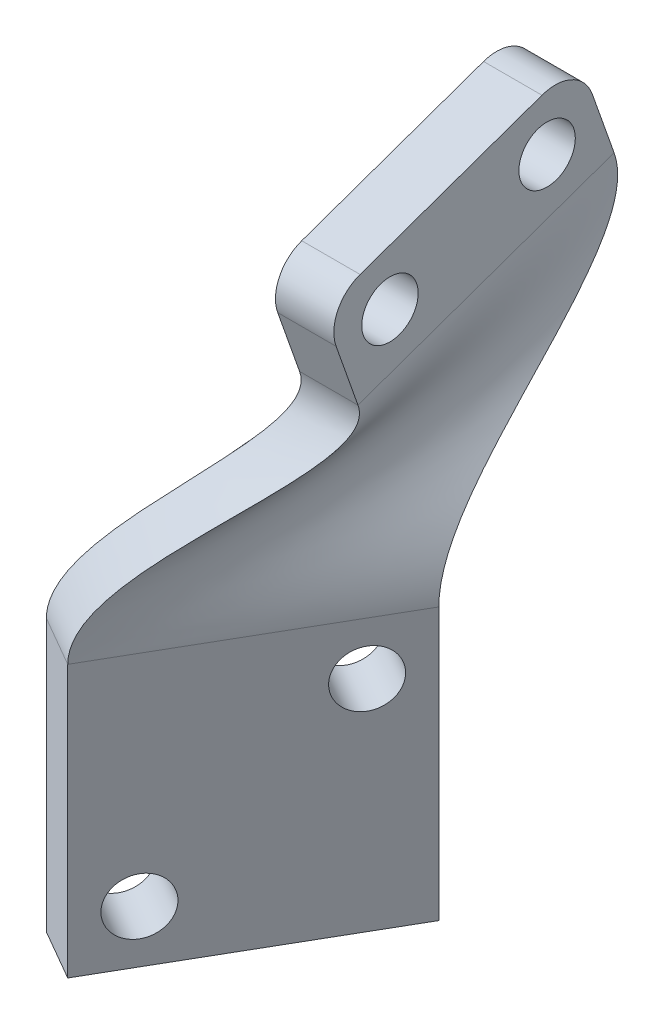
ISO-10303-21;
HEADER;
FILE_DESCRIPTION(('STEP AP214'),'2;1');
FILE_NAME('part.step','',(''),(''),'','','');
FILE_SCHEMA(('AUTOMOTIVE_DESIGN { 1 0 10303 214 1 1 1 1 }'));
ENDSEC;
DATA;
#1=APPLICATION_CONTEXT('core data for automotive mechanical design processes');
#2=APPLICATION_PROTOCOL_DEFINITION('international standard','automotive_design',2000,#1);
#3=PRODUCT_CONTEXT('',#1,'mechanical');
#4=PRODUCT('Part','Part','',(#3));
#5=PRODUCT_RELATED_PRODUCT_CATEGORY('part','',(#4));
#6=PRODUCT_DEFINITION_FORMATION('','',#4);
#7=PRODUCT_DEFINITION_CONTEXT('part definition',#1,'design');
#8=PRODUCT_DEFINITION('design','',#6,#7);
#9=PRODUCT_DEFINITION_SHAPE('','',#8);
#10=(LENGTH_UNIT() NAMED_UNIT(*) SI_UNIT(.MILLI.,.METRE.));
#11=(NAMED_UNIT(*) PLANE_ANGLE_UNIT() SI_UNIT($,.RADIAN.));
#12=(NAMED_UNIT(*) SI_UNIT($,.STERADIAN.) SOLID_ANGLE_UNIT());
#13=UNCERTAINTY_MEASURE_WITH_UNIT(LENGTH_MEASURE(1.E-05),#10,'distance_accuracy_value','');
#14=(GEOMETRIC_REPRESENTATION_CONTEXT(3) GLOBAL_UNCERTAINTY_ASSIGNED_CONTEXT((#13)) GLOBAL_UNIT_ASSIGNED_CONTEXT((#10,
#11,#12)) REPRESENTATION_CONTEXT('',''));
#15=CARTESIAN_POINT('',(0.,0.,0.));
#16=DIRECTION('',(0.,0.,1.));
#17=DIRECTION('',(1.,0.,0.));
#18=AXIS2_PLACEMENT_3D('',#15,#16,#17);
#19=CARTESIAN_POINT('',(36.0126016447789,0.,20.7918852538318));
#20=DIRECTION('',(0.866025403784439,0.,0.5));
#21=DIRECTION('',(-0.5,0.,0.866025403784439));
#22=AXIS2_PLACEMENT_3D('',#19,#20,#21);
#23=PLANE('',#22);
#24=CARTESIAN_POINT('',(-21.2182498916146,15.127724603936,119.918627875297));
#25=DIRECTION('',(-0.866025403784438,0.,-0.5));
#26=DIRECTION('',(-0.5,0.,0.866025403784438));
#27=AXIS2_PLACEMENT_3D('',#24,#25,#26);
#28=CIRCLE('',#27,2.15000000000001);
#29=CARTESIAN_POINT('',(-22.2932498916146,15.127724603936,121.780582493433));
#30=VERTEX_POINT('',#29);
#31=EDGE_CURVE('E308',#30,#30,#28,.T.);
#32=ORIENTED_EDGE('',*,*,#31,.T.);
#33=EDGE_LOOP('',(#32));
#34=FACE_BOUND('',#33,.T.);
#35=DIRECTION('',(0.,-1.,0.));
#36=VECTOR('',#35,1.);
#37=CARTESIAN_POINT('',(-19.2182498916146,19.127724603936,116.454526260159));
#38=LINE('',#37,#36);
#39=CARTESIAN_POINT('',(-19.2182498916146,19.127724603936,116.454526260159));
#40=VERTEX_POINT('',#39);
#41=CARTESIAN_POINT('',(-19.2182498916146,-1.57227539606404,116.454526260159));
#42=VERTEX_POINT('',#41);
#43=EDGE_CURVE('E318',#40,#42,#38,.T.);
#44=ORIENTED_EDGE('',*,*,#43,.F.);
#45=DIRECTION('',(-0.5,0.,0.866025403784439));
#46=VECTOR('',#45,1.);
#47=CARTESIAN_POINT('',(36.0126016447789,19.127724603936,20.7918852538319));
#48=LINE('',#47,#46);
#49=CARTESIAN_POINT('',(-29.5682498916146,19.127724603936,134.381252118497));
#50=VERTEX_POINT('',#49);
#51=EDGE_CURVE('E152',#50,#40,#48,.F.);
#52=ORIENTED_EDGE('',*,*,#51,.F.);
#53=DIRECTION('',(0.,1.,0.));
#54=VECTOR('',#53,1.);
#55=CARTESIAN_POINT('',(-29.5682498916146,19.127724603936,134.381252118497));
#56=LINE('',#55,#54);
#57=CARTESIAN_POINT('',(-29.5682498916146,-1.57227539606404,134.381252118497));
#58=VERTEX_POINT('',#57);
#59=EDGE_CURVE('E317',#58,#50,#56,.T.);
#60=ORIENTED_EDGE('',*,*,#59,.F.);
#61=DIRECTION('',(-0.5,0.,0.866025403784439));
#62=VECTOR('',#61,1.);
#63=CARTESIAN_POINT('',(-19.2182498916146,-1.57227539606404,116.454526260159));
#64=LINE('',#63,#62);
#65=EDGE_CURVE('E314',#42,#58,#64,.T.);
#66=ORIENTED_EDGE('',*,*,#65,.F.);
#67=EDGE_LOOP('',(#44,#52,#60,#66));
#68=FACE_BOUND('',#67,.T.);
#69=CARTESIAN_POINT('',(-27.5682498916146,2.42772460393596,130.917150503359));
#70=DIRECTION('',(-0.866025403784438,0.,-0.5));
#71=DIRECTION('',(-0.5,0.,0.866025403784438));
#72=AXIS2_PLACEMENT_3D('',#69,#70,#71);
#73=CIRCLE('',#72,2.15000000000001);
#74=CARTESIAN_POINT('',(-28.6432498916146,2.42772460393596,132.779105121496));
#75=VERTEX_POINT('',#74);
#76=EDGE_CURVE('E296',#75,#75,#73,.T.);
#77=ORIENTED_EDGE('',*,*,#76,.T.);
#78=EDGE_LOOP('',(#77));
#79=FACE_BOUND('',#78,.T.);
#80=ADVANCED_FACE('F45',(#34,#68,#79),#23,.T.);
#81=CARTESIAN_POINT('',(32.1587885979381,0.,18.5668852538318));
#82=DIRECTION('',(0.866025403784439,0.,0.5));
#83=DIRECTION('',(-0.5,0.,0.866025403784439));
#84=AXIS2_PLACEMENT_3D('',#81,#82,#83);
#85=PLANE('',#84);
#86=DIRECTION('',(0.,-1.,0.));
#87=VECTOR('',#86,1.);
#88=CARTESIAN_POINT('',(-23.0720629384553,19.127724603936,114.229526260159));
#89=LINE('',#88,#87);
#90=CARTESIAN_POINT('',(-23.0720629384553,19.127724603936,114.229526260159));
#91=VERTEX_POINT('',#90);
#92=CARTESIAN_POINT('',(-23.0720629384553,-1.57227539606404,114.229526260159));
#93=VERTEX_POINT('',#92);
#94=EDGE_CURVE('E311',#91,#93,#89,.T.);
#95=ORIENTED_EDGE('',*,*,#94,.T.);
#96=DIRECTION('',(-0.5,0.,0.866025403784439));
#97=VECTOR('',#96,1.);
#98=CARTESIAN_POINT('',(-23.0720629384553,-1.57227539606404,114.229526260159));
#99=LINE('',#98,#97);
#100=CARTESIAN_POINT('',(-33.4220629384554,-1.57227539606403,132.156252118497));
#101=VERTEX_POINT('',#100);
#102=EDGE_CURVE('E319',#93,#101,#99,.T.);
#103=ORIENTED_EDGE('',*,*,#102,.T.);
#104=DIRECTION('',(0.,1.,0.));
#105=VECTOR('',#104,1.);
#106=CARTESIAN_POINT('',(-33.4220629384554,19.127724603936,132.156252118497));
#107=LINE('',#106,#105);
#108=CARTESIAN_POINT('',(-33.4220629384554,19.127724603936,132.156252118497));
#109=VERTEX_POINT('',#108);
#110=EDGE_CURVE('E322',#101,#109,#107,.T.);
#111=ORIENTED_EDGE('',*,*,#110,.T.);
#112=DIRECTION('',(-0.5,0.,0.866025403784439));
#113=VECTOR('',#112,1.);
#114=CARTESIAN_POINT('',(32.1587885979381,19.127724603936,18.5668852538318));
#115=LINE('',#114,#113);
#116=EDGE_CURVE('E330',#109,#91,#115,.F.);
#117=ORIENTED_EDGE('',*,*,#116,.T.);
#118=EDGE_LOOP('',(#95,#103,#111,#117));
#119=FACE_BOUND('',#118,.T.);
#120=CARTESIAN_POINT('',(-25.0720629384553,15.127724603936,117.693627875297));
#121=DIRECTION('',(-0.866025403784438,0.,-0.5));
#122=DIRECTION('',(-0.5,0.,0.866025403784438));
#123=AXIS2_PLACEMENT_3D('',#120,#121,#122);
#124=CIRCLE('',#123,2.15000000000001);
#125=CARTESIAN_POINT('',(-26.1470629384553,15.127724603936,119.555582493433));
#126=VERTEX_POINT('',#125);
#127=EDGE_CURVE('E304',#126,#126,#124,.T.);
#128=ORIENTED_EDGE('',*,*,#127,.F.);
#129=EDGE_LOOP('',(#128));
#130=FACE_BOUND('',#129,.T.);
#131=CARTESIAN_POINT('',(-31.4220629384554,2.42772460393596,128.692150503359));
#132=DIRECTION('',(-0.866025403784438,0.,-0.5));
#133=DIRECTION('',(-0.5,0.,0.866025403784438));
#134=AXIS2_PLACEMENT_3D('',#131,#132,#133);
#135=CIRCLE('',#134,2.15000000000001);
#136=CARTESIAN_POINT('',(-32.4970629384554,2.42772460393596,130.554105121496));
#137=VERTEX_POINT('',#136);
#138=EDGE_CURVE('E305',#137,#137,#135,.T.);
#139=ORIENTED_EDGE('',*,*,#138,.F.);
#140=EDGE_LOOP('',(#139));
#141=FACE_BOUND('',#140,.T.);
#142=ADVANCED_FACE('F348',(#119,#130,#141),#85,.F.);
#143=CARTESIAN_POINT('',(-19.2182498916146,19.127724603936,116.454526260159));
#144=DIRECTION('',(-0.500000000000001,0.,0.866025403784438));
#145=DIRECTION('',(-0.866025403784438,0.,-0.500000000000001));
#146=AXIS2_PLACEMENT_3D('',#143,#144,#145);
#147=PLANE('',#146);
#148=ORIENTED_EDGE('',*,*,#94,.F.);
#149=DIRECTION('',(-0.866025403784438,0.,-0.500000000000001));
#150=VECTOR('',#149,1.);
#151=CARTESIAN_POINT('',(-19.2182498916146,19.127724603936,116.454526260159));
#152=LINE('',#151,#150);
#153=EDGE_CURVE('E341',#40,#91,#152,.T.);
#154=ORIENTED_EDGE('',*,*,#153,.F.);
#155=ORIENTED_EDGE('',*,*,#43,.T.);
#156=DIRECTION('',(-0.866025403784438,0.,-0.500000000000001));
#157=VECTOR('',#156,1.);
#158=CARTESIAN_POINT('',(-19.2182498916146,-1.57227539606404,116.454526260159));
#159=LINE('',#158,#157);
#160=EDGE_CURVE('E325',#42,#93,#159,.T.);
#161=ORIENTED_EDGE('',*,*,#160,.T.);
#162=EDGE_LOOP('',(#148,#154,#155,#161));
#163=FACE_BOUND('',#162,.T.);
#164=ADVANCED_FACE('F351',(#163),#147,.F.);
#165=CARTESIAN_POINT('',(-19.2182498916146,-1.57227539606404,116.454526260159));
#166=DIRECTION('',(0.,1.,0.));
#167=DIRECTION('',(-1.,0.,0.));
#168=AXIS2_PLACEMENT_3D('',#165,#166,#167);
#169=PLANE('',#168);
#170=ORIENTED_EDGE('',*,*,#102,.F.);
#171=ORIENTED_EDGE('',*,*,#160,.F.);
#172=ORIENTED_EDGE('',*,*,#65,.T.);
#173=DIRECTION('',(-0.866025403784438,0.,-0.500000000000001));
#174=VECTOR('',#173,1.);
#175=CARTESIAN_POINT('',(-29.5682498916146,-1.57227539606404,134.381252118497));
#176=LINE('',#175,#174);
#177=EDGE_CURVE('E323',#58,#101,#176,.T.);
#178=ORIENTED_EDGE('',*,*,#177,.T.);
#179=EDGE_LOOP('',(#170,#171,#172,#178));
#180=FACE_BOUND('',#179,.T.);
#181=ADVANCED_FACE('F355',(#180),#169,.F.);
#182=CARTESIAN_POINT('',(-29.5682498916146,19.127724603936,134.381252118497));
#183=DIRECTION('',(0.500000000000001,0.,-0.866025403784438));
#184=DIRECTION('',(0.866025403784438,0.,0.500000000000001));
#185=AXIS2_PLACEMENT_3D('',#182,#183,#184);
#186=PLANE('',#185);
#187=ORIENTED_EDGE('',*,*,#110,.F.);
#188=ORIENTED_EDGE('',*,*,#177,.F.);
#189=ORIENTED_EDGE('',*,*,#59,.T.);
#190=DIRECTION('',(0.866025403784438,0.,0.500000000000001));
#191=VECTOR('',#190,1.);
#192=CARTESIAN_POINT('',(-29.5682498916146,19.127724603936,134.381252118497));
#193=LINE('',#192,#191);
#194=EDGE_CURVE('E326',#50,#109,#193,.F.);
#195=ORIENTED_EDGE('',*,*,#194,.T.);
#196=EDGE_LOOP('',(#187,#188,#189,#195));
#197=FACE_BOUND('',#196,.T.);
#198=ADVANCED_FACE('F358',(#197),#186,.F.);
#199=CARTESIAN_POINT('',(-21.2182498916146,15.127724603936,119.918627875297));
#200=DIRECTION('',(-0.866025403784438,0.,-0.500000000000001));
#201=DIRECTION('',(0.500000000000001,0.,-0.866025403784438));
#202=AXIS2_PLACEMENT_3D('',#199,#200,#201);
#203=CYLINDRICAL_SURFACE('',#202,2.15000000000001);
#204=ORIENTED_EDGE('',*,*,#31,.F.);
#205=EDGE_LOOP('',(#204));
#206=FACE_BOUND('',#205,.T.);
#207=ORIENTED_EDGE('',*,*,#127,.T.);
#208=EDGE_LOOP('',(#207));
#209=FACE_BOUND('',#208,.T.);
#210=ADVANCED_FACE('F406',(#206,#209),#203,.F.);
#211=CARTESIAN_POINT('',(-27.5682498916146,2.42772460393596,130.917150503359));
#212=DIRECTION('',(-0.866025403784438,0.,-0.500000000000001));
#213=DIRECTION('',(0.500000000000001,0.,-0.866025403784438));
#214=AXIS2_PLACEMENT_3D('',#211,#212,#213);
#215=CYLINDRICAL_SURFACE('',#214,2.15000000000001);
#216=ORIENTED_EDGE('',*,*,#76,.F.);
#217=EDGE_LOOP('',(#216));
#218=FACE_BOUND('',#217,.T.);
#219=ORIENTED_EDGE('',*,*,#138,.T.);
#220=EDGE_LOOP('',(#219));
#221=FACE_BOUND('',#220,.T.);
#222=ADVANCED_FACE('F283',(#218,#221),#215,.F.);
#223=CARTESIAN_POINT('',(-19.9264999621046,34.817114234562,121.906255403122));
#224=CARTESIAN_POINT('',(-19.9264999621046,29.2862079287101,119.950784725634));
#225=CARTESIAN_POINT('',(-29.5682498916146,25.6682197655225,134.381252118497));
#226=CARTESIAN_POINT('',(-29.5682498916146,19.127724603936,134.381252118497));
#227=CARTESIAN_POINT('',(-19.9264999621046,35.967114234562,118.653564209663));
#228=CARTESIAN_POINT('',(-19.9264999621046,30.2410842644885,116.629106899105));
#229=CARTESIAN_POINT('',(-27.8432498916146,25.8957224361537,131.393464475441));
#230=CARTESIAN_POINT('',(-27.8432498916146,19.127724603936,131.393464475441));
#231=CARTESIAN_POINT('',(-19.9264999621046,38.267114234562,112.148181822747));
#232=CARTESIAN_POINT('',(-19.9264999621046,32.1508369360455,109.985751246048));
#233=CARTESIAN_POINT('',(-24.3932498916146,26.3507277774162,125.417889189328));
#234=CARTESIAN_POINT('',(-24.3932498916146,19.127724603936,125.417889189328));
#235=CARTESIAN_POINT('',(-19.9264999621046,40.567114234562,105.642799435831));
#236=CARTESIAN_POINT('',(-19.9264999621046,33.79014282889,103.246778217402));
#237=CARTESIAN_POINT('',(-20.9432498916146,27.0925852454451,119.442313903215));
#238=CARTESIAN_POINT('',(-20.9432498916146,19.127724603936,119.442313903215));
#239=CARTESIAN_POINT('',(-19.9264999621046,41.717114234562,102.390108242373));
#240=CARTESIAN_POINT('',(-19.9264999621046,34.6097957753123,99.8772917030789));
#241=CARTESIAN_POINT('',(-19.2182498916146,27.4635139794595,116.454526260159));
#242=CARTESIAN_POINT('',(-19.2182498916146,19.127724603936,116.454526260159));
#243=B_SPLINE_SURFACE_WITH_KNOTS('',3,3,((#223,#224,#225,#226),(#227,#228,#229,#230),(#231,#232,
#233,#234),(#235,#236,#237,#238),(#239,#240,#241,#242)),.UNSPECIFIED.,.F.,.F.,.F.,(4,1,4),(4,4),
(0.,0.5,1.),(0.,1.),.UNSPECIFIED.);
#244=CARTESIAN_POINT('',(-19.9264999621046,41.717114234562,102.390108242373));
#245=CARTESIAN_POINT('',(-19.9264999621046,40.567114234562,105.642799435831));
#246=CARTESIAN_POINT('',(-19.9264999621046,38.267114234562,112.148181822747));
#247=CARTESIAN_POINT('',(-19.9264999621046,35.967114234562,118.653564209663));
#248=CARTESIAN_POINT('',(-19.9264999621046,34.817114234562,121.906255403122));
#249=B_SPLINE_CURVE_WITH_KNOTS('',3,(#244,#245,#246,#247,#248),.UNSPECIFIED.,.F.,.F.,(4,1,4),
(0.,0.5,1.),.UNSPECIFIED.);
#250=CARTESIAN_POINT('',(-19.9264999621046,34.817114234562,121.906255403122));
#251=VERTEX_POINT('',#250);
#252=CARTESIAN_POINT('',(-19.9264999621046,41.717114234562,102.390108242373));
#253=VERTEX_POINT('',#252);
#254=EDGE_CURVE('E143',#251,#253,#249,.F.);
#255=CARTESIAN_POINT('',(-19.9264999621046,34.817114234562,121.906255403122));
#256=CARTESIAN_POINT('',(-19.9264999621046,29.2862079287101,119.950784725634));
#257=CARTESIAN_POINT('',(-29.5682498916146,25.6682197655225,134.381252118497));
#258=CARTESIAN_POINT('',(-29.5682498916146,19.127724603936,134.381252118497));
#259=B_SPLINE_CURVE_WITH_KNOTS('',3,(#255,#256,#257,#258),.UNSPECIFIED.,.F.,.F.,(4,4),(0.,1.),.UNSPECIFIED.);
#260=EDGE_CURVE('E154',#50,#251,#259,.F.);
#261=CARTESIAN_POINT('',(-19.9264999621046,41.717114234562,102.390108242373));
#262=CARTESIAN_POINT('',(-19.9264999621046,34.6097957753123,99.8772917030789));
#263=CARTESIAN_POINT('',(-19.2182498916146,27.4635139794595,116.454526260159));
#264=CARTESIAN_POINT('',(-19.2182498916146,19.127724603936,116.454526260159));
#265=B_SPLINE_CURVE_WITH_KNOTS('',3,(#261,#262,#263,#264),.UNSPECIFIED.,.F.,.F.,(4,4),(0.,1.),.UNSPECIFIED.);
#266=EDGE_CURVE('E139',#253,#40,#265,.T.);
#267=ORIENTED_EDGE('',*,*,#254,.F.);
#268=ORIENTED_EDGE('',*,*,#260,.F.);
#269=ORIENTED_EDGE('',*,*,#51,.T.);
#270=ORIENTED_EDGE('',*,*,#266,.F.);
#271=EDGE_LOOP('',(#267,#268,#269,#270));
#272=FACE_BOUND('',#271,.T.);
#273=ADVANCED_FACE('F149',(#272),#243,.F.);
#274=CARTESIAN_POINT('',(-19.9264999621046,41.717114234562,102.390108242373));
#275=CARTESIAN_POINT('',(-19.9264999621046,34.6097957753123,99.8772917030789));
#276=CARTESIAN_POINT('',(-19.2182498916146,27.4635139794595,116.454526260159));
#277=CARTESIAN_POINT('',(-19.2182498916146,19.127724603936,116.454526260159));
#278=CARTESIAN_POINT('',(-20.6681666287712,41.717114234562,102.390108242373));
#279=CARTESIAN_POINT('',(-20.6681666287712,34.6301319000847,99.8844816089437));
#280=CARTESIAN_POINT('',(-19.860552066088,27.4254627803836,116.083692926826));
#281=CARTESIAN_POINT('',(-19.860552066088,19.127724603936,116.083692926826));
#282=CARTESIAN_POINT('',(-22.1514999621046,41.717114234562,102.390108242373));
#283=CARTESIAN_POINT('',(-22.1514999621046,34.6708041496295,99.8988614206733));
#284=CARTESIAN_POINT('',(-21.145156415035,27.3493603822318,115.342026260159));
#285=CARTESIAN_POINT('',(-21.145156415035,19.127724603936,115.342026260159));
#286=CARTESIAN_POINT('',(-23.6348332954379,41.717114234562,102.390108242373));
#287=CARTESIAN_POINT('',(-23.6348332954379,34.7039985098561,99.9105973992801));
#288=CARTESIAN_POINT('',(-22.4297607639819,27.2811894834487,114.600359593492));
#289=CARTESIAN_POINT('',(-22.4297607639819,19.127724603936,114.600359593492));
#290=CARTESIAN_POINT('',(-24.3764999621046,41.717114234562,102.390108242373));
#291=CARTESIAN_POINT('',(-24.3764999621046,34.7205956899694,99.9164653885834));
#292=CARTESIAN_POINT('',(-23.0720629384553,27.2471040340572,114.229526260159));
#293=CARTESIAN_POINT('',(-23.0720629384553,19.127724603936,114.229526260159));
#294=B_SPLINE_SURFACE_WITH_KNOTS('',3,3,((#274,#275,#276,#277),(#278,#279,#280,#281),(#282,#283,
#284,#285),(#286,#287,#288,#289),(#290,#291,#292,#293)),.UNSPECIFIED.,.F.,.F.,.F.,(4,1,4),(4,4),
(0.,0.5,1.),(0.,1.),.UNSPECIFIED.);
#295=CARTESIAN_POINT('',(-24.3764999621046,41.717114234562,102.390108242373));
#296=CARTESIAN_POINT('',(-23.6348332954379,41.717114234562,102.390108242373));
#297=CARTESIAN_POINT('',(-22.1514999621046,41.717114234562,102.390108242373));
#298=CARTESIAN_POINT('',(-20.6681666287712,41.717114234562,102.390108242373));
#299=CARTESIAN_POINT('',(-19.9264999621046,41.717114234562,102.390108242373));
#300=B_SPLINE_CURVE_WITH_KNOTS('',3,(#295,#296,#297,#298,#299),.UNSPECIFIED.,.F.,.F.,(4,1,4),
(0.,0.5,1.),.UNSPECIFIED.);
#301=CARTESIAN_POINT('',(-24.3764999621046,41.717114234562,102.390108242373));
#302=VERTEX_POINT('',#301);
#303=EDGE_CURVE('E125',#302,#253,#300,.T.);
#304=CARTESIAN_POINT('',(-24.3764999621046,41.717114234562,102.390108242373));
#305=CARTESIAN_POINT('',(-24.3764999621046,34.7205956899694,99.9164653885834));
#306=CARTESIAN_POINT('',(-23.0720629384553,27.2471040340572,114.229526260159));
#307=CARTESIAN_POINT('',(-23.0720629384553,19.127724603936,114.229526260159));
#308=B_SPLINE_CURVE_WITH_KNOTS('',3,(#304,#305,#306,#307),.UNSPECIFIED.,.F.,.F.,(4,4),(0.,1.),.UNSPECIFIED.);
#309=EDGE_CURVE('E141',#302,#91,#308,.T.);
#310=ORIENTED_EDGE('',*,*,#303,.T.);
#311=ORIENTED_EDGE('',*,*,#266,.T.);
#312=ORIENTED_EDGE('',*,*,#153,.T.);
#313=ORIENTED_EDGE('',*,*,#309,.F.);
#314=EDGE_LOOP('',(#310,#311,#312,#313));
#315=FACE_BOUND('',#314,.T.);
#316=ADVANCED_FACE('F137',(#315),#294,.F.);
#317=CARTESIAN_POINT('',(-24.3764999621046,34.817114234562,121.906255403122));
#318=CARTESIAN_POINT('',(-24.3764999621046,29.4632272896416,120.013370520892));
#319=CARTESIAN_POINT('',(-33.4220629384554,25.3815734908596,132.156252118497));
#320=CARTESIAN_POINT('',(-33.4220629384554,19.127724603936,132.156252118497));
#321=CARTESIAN_POINT('',(-23.6348332954379,34.817114234562,121.906255403122));
#322=CARTESIAN_POINT('',(-23.6348332954379,29.4355051877699,120.003569277781));
#323=CARTESIAN_POINT('',(-32.7797607639819,25.4274587016744,132.52708545183));
#324=CARTESIAN_POINT('',(-32.7797607639819,19.127724603936,132.52708545183));
#325=CARTESIAN_POINT('',(-22.1514999621046,34.817114234562,121.906255403122));
#326=CARTESIAN_POINT('',(-22.1514999621046,29.3800609840265,119.983966791559));
#327=CARTESIAN_POINT('',(-31.495156415035,25.519229123304,133.268752118497));
#328=CARTESIAN_POINT('',(-31.495156415035,19.127724603936,133.268752118497));
#329=CARTESIAN_POINT('',(-20.6681666287713,34.817114234562,121.906255403122));
#330=CARTESIAN_POINT('',(-20.6681666287713,29.3174922804822,119.961845414275));
#331=CARTESIAN_POINT('',(-30.2105520660881,25.6185562181163,134.010418785164));
#332=CARTESIAN_POINT('',(-30.2105520660881,19.127724603936,134.010418785164));
#333=CARTESIAN_POINT('',(-19.9264999621046,34.817114234562,121.906255403122));
#334=CARTESIAN_POINT('',(-19.9264999621046,29.2862079287101,119.950784725634));
#335=CARTESIAN_POINT('',(-29.5682498916146,25.6682197655225,134.381252118497));
#336=CARTESIAN_POINT('',(-29.5682498916146,19.127724603936,134.381252118497));
#337=B_SPLINE_SURFACE_WITH_KNOTS('',3,3,((#317,#318,#319,#320),(#321,#322,#323,#324),(#325,#326,
#327,#328),(#329,#330,#331,#332),(#333,#334,#335,#336)),.UNSPECIFIED.,.F.,.F.,.F.,(4,1,4),(4,4),
(0.,0.5,1.),(0.,1.),.UNSPECIFIED.);
#338=CARTESIAN_POINT('',(-19.9264999621046,34.817114234562,121.906255403122));
#339=CARTESIAN_POINT('',(-20.6681666287713,34.817114234562,121.906255403122));
#340=CARTESIAN_POINT('',(-22.1514999621046,34.817114234562,121.906255403122));
#341=CARTESIAN_POINT('',(-23.6348332954379,34.817114234562,121.906255403122));
#342=CARTESIAN_POINT('',(-24.3764999621046,34.817114234562,121.906255403122));
#343=B_SPLINE_CURVE_WITH_KNOTS('',3,(#338,#339,#340,#341,#342),.UNSPECIFIED.,.F.,.F.,(4,1,4),
(0.,0.5,1.),.UNSPECIFIED.);
#344=CARTESIAN_POINT('',(-24.3764999621046,34.817114234562,121.906255403122));
#345=VERTEX_POINT('',#344);
#346=EDGE_CURVE('E249',#345,#251,#343,.F.);
#347=CARTESIAN_POINT('',(-24.3764999621046,34.817114234562,121.906255403122));
#348=CARTESIAN_POINT('',(-24.3764999621046,29.4632272896416,120.013370520892));
#349=CARTESIAN_POINT('',(-33.4220629384554,25.3815734908596,132.156252118497));
#350=CARTESIAN_POINT('',(-33.4220629384554,19.127724603936,132.156252118497));
#351=B_SPLINE_CURVE_WITH_KNOTS('',3,(#347,#348,#349,#350),.UNSPECIFIED.,.F.,.F.,(4,4),(0.,1.),.UNSPECIFIED.);
#352=EDGE_CURVE('E254',#345,#109,#351,.T.);
#353=ORIENTED_EDGE('',*,*,#346,.F.);
#354=ORIENTED_EDGE('',*,*,#352,.T.);
#355=ORIENTED_EDGE('',*,*,#194,.F.);
#356=ORIENTED_EDGE('',*,*,#260,.T.);
#357=EDGE_LOOP('',(#353,#354,#355,#356));
#358=FACE_BOUND('',#357,.T.);
#359=ADVANCED_FACE('F256',(#358),#337,.F.);
#360=CARTESIAN_POINT('',(-24.3764999621046,41.717114234562,102.390108242373));
#361=CARTESIAN_POINT('',(-24.3764999621046,34.7205956899694,99.9164653885834));
#362=CARTESIAN_POINT('',(-23.0720629384553,27.2471040340572,114.229526260159));
#363=CARTESIAN_POINT('',(-23.0720629384553,19.127724603936,114.229526260159));
#364=CARTESIAN_POINT('',(-24.3764999621046,40.567114234562,105.642799435831));
#365=CARTESIAN_POINT('',(-24.3764999621046,33.9140889858176,103.290599801435));
#366=CARTESIAN_POINT('',(-24.7970629384553,26.862231604458,117.217313903215));
#367=CARTESIAN_POINT('',(-24.7970629384553,19.127724603936,117.217313903215));
#368=CARTESIAN_POINT('',(-24.3764999621046,38.267114234562,112.148181822747));
#369=CARTESIAN_POINT('',(-24.3764999621046,32.3010755775138,110.038868627137));
#370=CARTESIAN_POINT('',(-28.2470629384553,26.0924867452595,123.192889189328));
#371=CARTESIAN_POINT('',(-28.2470629384553,19.127724603936,123.192889189328));
#372=CARTESIAN_POINT('',(-24.3764999621046,35.967114234562,118.653564209663));
#373=CARTESIAN_POINT('',(-24.3764999621046,30.4091767189324,116.688536556307));
#374=CARTESIAN_POINT('',(-31.6970629384554,25.6185445756596,129.168464475441));
#375=CARTESIAN_POINT('',(-31.6970629384554,19.127724603936,129.168464475441));
#376=CARTESIAN_POINT('',(-24.3764999621046,34.817114234562,121.906255403122));
#377=CARTESIAN_POINT('',(-24.3764999621046,29.4632272896416,120.013370520892));
#378=CARTESIAN_POINT('',(-33.4220629384554,25.3815734908596,132.156252118497));
#379=CARTESIAN_POINT('',(-33.4220629384554,19.127724603936,132.156252118497));
#380=B_SPLINE_SURFACE_WITH_KNOTS('',3,3,((#360,#361,#362,#363),(#364,#365,#366,#367),(#368,#369,
#370,#371),(#372,#373,#374,#375),(#376,#377,#378,#379)),.UNSPECIFIED.,.F.,.F.,.F.,(4,1,4),(4,4),
(0.,0.5,1.),(0.,1.),.UNSPECIFIED.);
#381=CARTESIAN_POINT('',(-24.3764999621046,34.817114234562,121.906255403122));
#382=CARTESIAN_POINT('',(-24.3764999621046,35.967114234562,118.653564209663));
#383=CARTESIAN_POINT('',(-24.3764999621046,38.267114234562,112.148181822747));
#384=CARTESIAN_POINT('',(-24.3764999621046,40.567114234562,105.642799435831));
#385=CARTESIAN_POINT('',(-24.3764999621046,41.717114234562,102.390108242373));
#386=B_SPLINE_CURVE_WITH_KNOTS('',3,(#381,#382,#383,#384,#385),.UNSPECIFIED.,.F.,.F.,(4,1,4),
(0.,0.5,1.),.UNSPECIFIED.);
#387=EDGE_CURVE('E142',#345,#302,#386,.T.);
#388=ORIENTED_EDGE('',*,*,#387,.T.);
#389=ORIENTED_EDGE('',*,*,#309,.T.);
#390=ORIENTED_EDGE('',*,*,#116,.F.);
#391=ORIENTED_EDGE('',*,*,#352,.F.);
#392=EDGE_LOOP('',(#388,#389,#390,#391));
#393=FACE_BOUND('',#392,.T.);
#394=ADVANCED_FACE('F268',(#393),#380,.F.);
#395=CARTESIAN_POINT('',(-24.3764999621045,0.,0.));
#396=DIRECTION('',(1.,0.,0.));
#397=DIRECTION('',(0.,0.,1.));
#398=AXIS2_PLACEMENT_3D('',#395,#396,#397);
#399=PLANE('',#398);
#400=DIRECTION('',(0.,0.942809041582063,0.333333333333335));
#401=VECTOR('',#400,1.);
#402=CARTESIAN_POINT('',(-24.3764999621046,49.2595865672185,105.05677490904));
#403=LINE('',#402,#401);
#404=CARTESIAN_POINT('',(-24.3764999621046,46.4311594424723,104.05677490904));
#405=VERTEX_POINT('',#404);
#406=EDGE_CURVE('E202',#302,#405,#403,.T.);
#407=ORIENTED_EDGE('',*,*,#406,.F.);
#408=ORIENTED_EDGE('',*,*,#387,.F.);
#409=DIRECTION('',(0.,-0.942809041582063,-0.333333333333334));
#410=VECTOR('',#409,1.);
#411=CARTESIAN_POINT('',(-24.3764999621046,34.817114234562,121.906255403122));
#412=LINE('',#411,#410);
#413=CARTESIAN_POINT('',(-24.3764999621046,39.5311594424723,123.572922069788));
#414=VERTEX_POINT('',#413);
#415=EDGE_CURVE('E209',#414,#345,#412,.T.);
#416=ORIENTED_EDGE('',*,*,#415,.F.);
#417=CARTESIAN_POINT('',(-24.3764999621046,40.5311594424723,120.744494945042));
#418=DIRECTION('',(-1.,0.,0.));
#419=DIRECTION('',(0.,0.,1.));
#420=AXIS2_PLACEMENT_3D('',#417,#418,#419);
#421=CIRCLE('',#420,3.);
#422=CARTESIAN_POINT('',(-24.3764999621046,43.3595865672185,121.744494945042));
#423=VERTEX_POINT('',#422);
#424=EDGE_CURVE('E232',#423,#414,#421,.F.);
#425=ORIENTED_EDGE('',*,*,#424,.F.);
#426=DIRECTION('',(0.,-0.333333333333334,0.942809041582063));
#427=VECTOR('',#426,1.);
#428=CARTESIAN_POINT('',(-24.3764999621046,42.3595865672185,124.572922069788));
#429=LINE('',#428,#427);
#430=CARTESIAN_POINT('',(-24.3764999621046,48.2595865672185,107.885202033786));
#431=VERTEX_POINT('',#430);
#432=EDGE_CURVE('E162',#431,#423,#429,.T.);
#433=ORIENTED_EDGE('',*,*,#432,.F.);
#434=CARTESIAN_POINT('',(-24.3764999621046,45.4311594424723,106.885202033786));
#435=DIRECTION('',(-1.,0.,0.));
#436=DIRECTION('',(0.,0.,1.));
#437=AXIS2_PLACEMENT_3D('',#434,#435,#436);
#438=CIRCLE('',#437,3.);
#439=EDGE_CURVE('E53',#405,#431,#438,.F.);
#440=ORIENTED_EDGE('',*,*,#439,.F.);
#441=EDGE_LOOP('',(#407,#408,#416,#425,#433,#440));
#442=FACE_BOUND('',#441,.T.);
#443=CARTESIAN_POINT('',(-24.3764999621046,44.1550170675569,107.494677742034));
#444=DIRECTION('',(1.,0.,0.));
#445=DIRECTION('',(0.,0.,-1.));
#446=AXIS2_PLACEMENT_3D('',#443,#444,#445);
#447=CIRCLE('',#446,2.15);
#448=CARTESIAN_POINT('',(-24.3764999621046,44.1550170675569,105.344677742034));
#449=VERTEX_POINT('',#448);
#450=EDGE_CURVE('E737',#449,#449,#447,.T.);
#451=ORIENTED_EDGE('',*,*,#450,.T.);
#452=EDGE_LOOP('',(#451));
#453=FACE_BOUND('',#452,.T.);
#454=CARTESIAN_POINT('',(-24.3764999621046,39.9216837342236,119.468352570127));
#455=DIRECTION('',(1.,0.,0.));
#456=DIRECTION('',(0.,0.,-1.));
#457=AXIS2_PLACEMENT_3D('',#454,#455,#456);
#458=CIRCLE('',#457,2.15);
#459=CARTESIAN_POINT('',(-24.3764999621046,39.9216837342236,117.318352570127));
#460=VERTEX_POINT('',#459);
#461=EDGE_CURVE('E741',#460,#460,#458,.T.);
#462=ORIENTED_EDGE('',*,*,#461,.T.);
#463=EDGE_LOOP('',(#462));
#464=FACE_BOUND('',#463,.T.);
#465=ADVANCED_FACE('F183',(#442,#453,#464),#399,.F.);
#466=CARTESIAN_POINT('',(-19.9264999621045,0.,0.));
#467=DIRECTION('',(1.,0.,0.));
#468=DIRECTION('',(0.,0.,1.));
#469=AXIS2_PLACEMENT_3D('',#466,#467,#468);
#470=PLANE('',#469);
#471=CARTESIAN_POINT('',(-19.9264999621046,44.1550170675569,107.494677742034));
#472=DIRECTION('',(1.,0.,0.));
#473=DIRECTION('',(0.,0.,-1.));
#474=AXIS2_PLACEMENT_3D('',#471,#472,#473);
#475=CIRCLE('',#474,2.15);
#476=CARTESIAN_POINT('',(-19.9264999621046,44.1550170675569,105.344677742034));
#477=VERTEX_POINT('',#476);
#478=EDGE_CURVE('E242',#477,#477,#475,.T.);
#479=ORIENTED_EDGE('',*,*,#478,.F.);
#480=EDGE_LOOP('',(#479));
#481=FACE_BOUND('',#480,.T.);
#482=DIRECTION('',(0.,-0.333333333333334,0.942809041582063));
#483=VECTOR('',#482,1.);
#484=CARTESIAN_POINT('',(-19.9264999621046,42.3595865672185,124.572922069788));
#485=LINE('',#484,#483);
#486=CARTESIAN_POINT('',(-19.9264999621046,48.2595865672185,107.885202033786));
#487=VERTEX_POINT('',#486);
#488=CARTESIAN_POINT('',(-19.9264999621046,43.3595865672185,121.744494945042));
#489=VERTEX_POINT('',#488);
#490=EDGE_CURVE('E130',#487,#489,#485,.T.);
#491=ORIENTED_EDGE('',*,*,#490,.T.);
#492=CARTESIAN_POINT('',(-19.9264999621046,40.5311594424723,120.744494945042));
#493=DIRECTION('',(-1.,0.,0.));
#494=DIRECTION('',(0.,0.,1.));
#495=AXIS2_PLACEMENT_3D('',#492,#493,#494);
#496=CIRCLE('',#495,3.);
#497=CARTESIAN_POINT('',(-19.9264999621046,39.5311594424723,123.572922069788));
#498=VERTEX_POINT('',#497);
#499=EDGE_CURVE('E732',#498,#489,#496,.T.);
#500=ORIENTED_EDGE('',*,*,#499,.F.);
#501=DIRECTION('',(0.,-0.942809041582063,-0.333333333333334));
#502=VECTOR('',#501,1.);
#503=CARTESIAN_POINT('',(-19.9264999621046,34.817114234562,121.906255403122));
#504=LINE('',#503,#502);
#505=EDGE_CURVE('E131',#498,#251,#504,.T.);
#506=ORIENTED_EDGE('',*,*,#505,.T.);
#507=ORIENTED_EDGE('',*,*,#254,.T.);
#508=DIRECTION('',(0.,0.942809041582063,0.333333333333335));
#509=VECTOR('',#508,1.);
#510=CARTESIAN_POINT('',(-19.9264999621046,49.2595865672185,105.05677490904));
#511=LINE('',#510,#509);
#512=CARTESIAN_POINT('',(-19.9264999621046,46.4311594424723,104.05677490904));
#513=VERTEX_POINT('',#512);
#514=EDGE_CURVE('E121',#253,#513,#511,.T.);
#515=ORIENTED_EDGE('',*,*,#514,.T.);
#516=CARTESIAN_POINT('',(-19.9264999621046,45.4311594424723,106.885202033786));
#517=DIRECTION('',(-1.,0.,0.));
#518=DIRECTION('',(0.,0.,1.));
#519=AXIS2_PLACEMENT_3D('',#516,#517,#518);
#520=CIRCLE('',#519,3.);
#521=EDGE_CURVE('E734',#487,#513,#520,.T.);
#522=ORIENTED_EDGE('',*,*,#521,.F.);
#523=EDGE_LOOP('',(#491,#500,#506,#507,#515,#522));
#524=FACE_BOUND('',#523,.T.);
#525=CARTESIAN_POINT('',(-19.9264999621046,39.9216837342236,119.468352570127));
#526=DIRECTION('',(1.,0.,0.));
#527=DIRECTION('',(0.,0.,-1.));
#528=AXIS2_PLACEMENT_3D('',#525,#526,#527);
#529=CIRCLE('',#528,2.15);
#530=CARTESIAN_POINT('',(-19.9264999621046,39.9216837342236,117.318352570127));
#531=VERTEX_POINT('',#530);
#532=EDGE_CURVE('E743',#531,#531,#529,.T.);
#533=ORIENTED_EDGE('',*,*,#532,.F.);
#534=EDGE_LOOP('',(#533));
#535=FACE_BOUND('',#534,.T.);
#536=ADVANCED_FACE('F158',(#481,#524,#535),#470,.T.);
#537=CARTESIAN_POINT('',(-24.3764999621046,34.817114234562,121.906255403122));
#538=DIRECTION('',(0.,0.333333333333334,-0.942809041582063));
#539=DIRECTION('',(0.,-0.942809041582063,-0.333333333333334));
#540=AXIS2_PLACEMENT_3D('',#537,#538,#539);
#541=PLANE('',#540);
#542=ORIENTED_EDGE('',*,*,#415,.T.);
#543=ORIENTED_EDGE('',*,*,#346,.T.);
#544=ORIENTED_EDGE('',*,*,#505,.F.);
#545=DIRECTION('',(1.,0.,0.));
#546=VECTOR('',#545,1.);
#547=CARTESIAN_POINT('',(-24.3764999621046,39.5311594424723,123.572922069788));
#548=LINE('',#547,#546);
#549=EDGE_CURVE('E12',#414,#498,#548,.T.);
#550=ORIENTED_EDGE('',*,*,#549,.F.);
#551=EDGE_LOOP('',(#542,#543,#544,#550));
#552=FACE_BOUND('',#551,.T.);
#553=ADVANCED_FACE('F182',(#552),#541,.F.);
#554=CARTESIAN_POINT('',(-24.3764999621046,49.2595865672185,105.05677490904));
#555=DIRECTION('',(0.,-0.333333333333335,0.942809041582063));
#556=DIRECTION('',(0.,0.942809041582063,0.333333333333335));
#557=AXIS2_PLACEMENT_3D('',#554,#555,#556);
#558=PLANE('',#557);
#559=ORIENTED_EDGE('',*,*,#514,.F.);
#560=ORIENTED_EDGE('',*,*,#303,.F.);
#561=ORIENTED_EDGE('',*,*,#406,.T.);
#562=DIRECTION('',(1.,0.,0.));
#563=VECTOR('',#562,1.);
#564=CARTESIAN_POINT('',(-24.3764999621046,46.4311594424723,104.05677490904));
#565=LINE('',#564,#563);
#566=EDGE_CURVE('E66',#513,#405,#565,.F.);
#567=ORIENTED_EDGE('',*,*,#566,.F.);
#568=EDGE_LOOP('',(#559,#560,#561,#567));
#569=FACE_BOUND('',#568,.T.);
#570=ADVANCED_FACE('F123',(#569),#558,.F.);
#571=CARTESIAN_POINT('',(-24.3764999621046,42.3595865672185,124.572922069788));
#572=DIRECTION('',(0.,-0.942809041582063,-0.333333333333334));
#573=DIRECTION('',(0.,-0.333333333333334,0.942809041582063));
#574=AXIS2_PLACEMENT_3D('',#571,#572,#573);
#575=PLANE('',#574);
#576=ORIENTED_EDGE('',*,*,#432,.T.);
#577=DIRECTION('',(1.,0.,0.));
#578=VECTOR('',#577,1.);
#579=CARTESIAN_POINT('',(-24.3764999621046,43.3595865672185,121.744494945042));
#580=LINE('',#579,#578);
#581=EDGE_CURVE('E171',#489,#423,#580,.F.);
#582=ORIENTED_EDGE('',*,*,#581,.F.);
#583=ORIENTED_EDGE('',*,*,#490,.F.);
#584=DIRECTION('',(1.,0.,0.));
#585=VECTOR('',#584,1.);
#586=CARTESIAN_POINT('',(-24.3764999621046,48.2595865672185,107.885202033786));
#587=LINE('',#586,#585);
#588=EDGE_CURVE('E235',#431,#487,#587,.T.);
#589=ORIENTED_EDGE('',*,*,#588,.F.);
#590=EDGE_LOOP('',(#576,#582,#583,#589));
#591=FACE_BOUND('',#590,.T.);
#592=ADVANCED_FACE('F187',(#591),#575,.F.);
#593=CARTESIAN_POINT('',(-24.3764999621046,44.1550170675569,107.494677742034));
#594=DIRECTION('',(1.,0.,0.));
#595=DIRECTION('',(0.,0.,1.));
#596=AXIS2_PLACEMENT_3D('',#593,#594,#595);
#597=CYLINDRICAL_SURFACE('',#596,2.15);
#598=ORIENTED_EDGE('',*,*,#450,.F.);
#599=EDGE_LOOP('',(#598));
#600=FACE_BOUND('',#599,.T.);
#601=ORIENTED_EDGE('',*,*,#478,.T.);
#602=EDGE_LOOP('',(#601));
#603=FACE_BOUND('',#602,.T.);
#604=ADVANCED_FACE('F190',(#600,#603),#597,.F.);
#605=CARTESIAN_POINT('',(-24.3764999621046,39.9216837342236,119.468352570127));
#606=DIRECTION('',(1.,0.,0.));
#607=DIRECTION('',(0.,0.,1.));
#608=AXIS2_PLACEMENT_3D('',#605,#606,#607);
#609=CYLINDRICAL_SURFACE('',#608,2.15);
#610=ORIENTED_EDGE('',*,*,#461,.F.);
#611=EDGE_LOOP('',(#610));
#612=FACE_BOUND('',#611,.T.);
#613=ORIENTED_EDGE('',*,*,#532,.T.);
#614=EDGE_LOOP('',(#613));
#615=FACE_BOUND('',#614,.T.);
#616=ADVANCED_FACE('F665',(#612,#615),#609,.F.);
#617=CARTESIAN_POINT('',(-24.3764999621046,45.4311594424723,106.885202033786));
#618=DIRECTION('',(1.,0.,0.));
#619=DIRECTION('',(0.,0.,1.));
#620=AXIS2_PLACEMENT_3D('',#617,#618,#619);
#621=CYLINDRICAL_SURFACE('',#620,3.);
#622=ORIENTED_EDGE('',*,*,#439,.T.);
#623=ORIENTED_EDGE('',*,*,#588,.T.);
#624=ORIENTED_EDGE('',*,*,#521,.T.);
#625=ORIENTED_EDGE('',*,*,#566,.T.);
#626=EDGE_LOOP('',(#622,#623,#624,#625));
#627=FACE_BOUND('',#626,.T.);
#628=ADVANCED_FACE('F234',(#627),#621,.T.);
#629=CARTESIAN_POINT('',(-24.3764999621046,40.5311594424723,120.744494945042));
#630=DIRECTION('',(1.,0.,0.));
#631=DIRECTION('',(0.,0.,1.));
#632=AXIS2_PLACEMENT_3D('',#629,#630,#631);
#633=CYLINDRICAL_SURFACE('',#632,3.);
#634=ORIENTED_EDGE('',*,*,#424,.T.);
#635=ORIENTED_EDGE('',*,*,#549,.T.);
#636=ORIENTED_EDGE('',*,*,#499,.T.);
#637=ORIENTED_EDGE('',*,*,#581,.T.);
#638=EDGE_LOOP('',(#634,#635,#636,#637));
#639=FACE_BOUND('',#638,.T.);
#640=ADVANCED_FACE('F47',(#639),#633,.T.);
#641=CLOSED_SHELL('',(#80,#142,#164,#181,#198,#210,#222,#273,#316,#359,#394,#465,#536,#553,#570,
#592,#604,#616,#628,#640));
#642=MANIFOLD_SOLID_BREP('B2',#641);
#643=ADVANCED_BREP_SHAPE_REPRESENTATION('',(#18,#642),#14);
#644=SHAPE_DEFINITION_REPRESENTATION(#9,#643);
ENDSEC;
END-ISO-10303-21;
